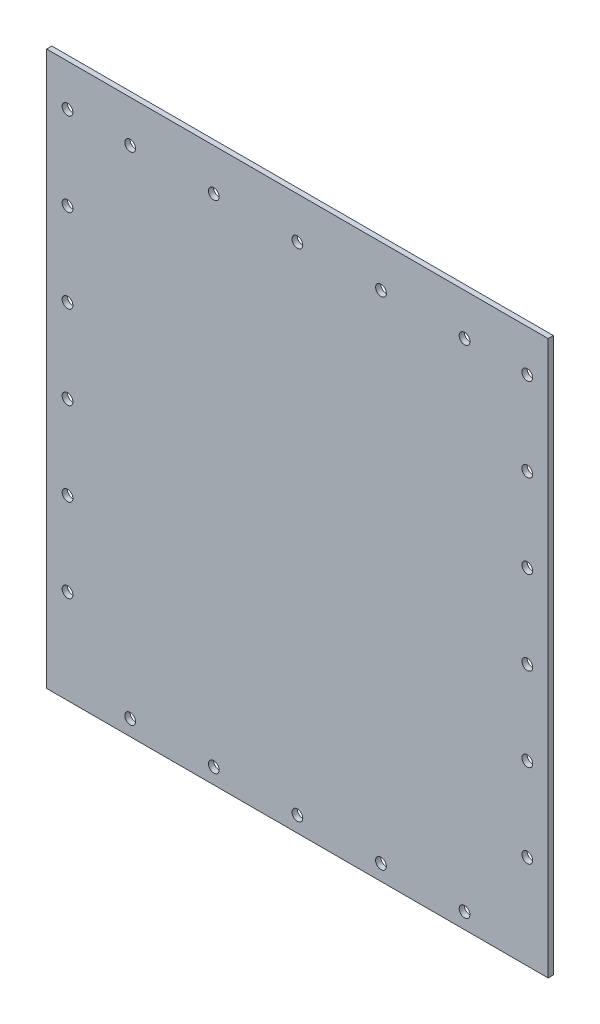
ISO-10303-21;
HEADER;
FILE_DESCRIPTION(('STEP AP214'),'2;1');
FILE_NAME('part.step','',(''),(''),'','','');
FILE_SCHEMA(('AUTOMOTIVE_DESIGN { 1 0 10303 214 1 1 1 1 }'));
ENDSEC;
DATA;
#1=APPLICATION_CONTEXT('core data for automotive mechanical design processes');
#2=APPLICATION_PROTOCOL_DEFINITION('international standard','automotive_design',2000,#1);
#3=PRODUCT_CONTEXT('',#1,'mechanical');
#4=PRODUCT('Part','Part','',(#3));
#5=PRODUCT_RELATED_PRODUCT_CATEGORY('part','',(#4));
#6=PRODUCT_DEFINITION_FORMATION('','',#4);
#7=PRODUCT_DEFINITION_CONTEXT('part definition',#1,'design');
#8=PRODUCT_DEFINITION('design','',#6,#7);
#9=PRODUCT_DEFINITION_SHAPE('','',#8);
#10=(LENGTH_UNIT() NAMED_UNIT(*) SI_UNIT(.MILLI.,.METRE.));
#11=(NAMED_UNIT(*) PLANE_ANGLE_UNIT() SI_UNIT($,.RADIAN.));
#12=(NAMED_UNIT(*) SI_UNIT($,.STERADIAN.) SOLID_ANGLE_UNIT());
#13=UNCERTAINTY_MEASURE_WITH_UNIT(LENGTH_MEASURE(1.E-05),#10,'distance_accuracy_value','');
#14=(GEOMETRIC_REPRESENTATION_CONTEXT(3) GLOBAL_UNCERTAINTY_ASSIGNED_CONTEXT((#13)) GLOBAL_UNIT_ASSIGNED_CONTEXT((#10,
#11,#12)) REPRESENTATION_CONTEXT('',''));
#15=CARTESIAN_POINT('',(0.,0.,0.));
#16=DIRECTION('',(0.,0.,1.));
#17=DIRECTION('',(1.,0.,0.));
#18=AXIS2_PLACEMENT_3D('',#15,#16,#17);
#19=CARTESIAN_POINT('',(0.,-101.6,1.5875));
#20=DIRECTION('',(0.,1.,0.));
#21=DIRECTION('',(0.,0.,1.));
#22=AXIS2_PLACEMENT_3D('',#19,#20,#21);
#23=PLANE('',#22);
#24=DIRECTION('',(1.,0.,0.));
#25=VECTOR('',#24,1.);
#26=CARTESIAN_POINT('',(0.,-101.6,0.));
#27=LINE('',#26,#25);
#28=CARTESIAN_POINT('',(0.,-101.6,0.));
#29=VERTEX_POINT('',#28);
#30=CARTESIAN_POINT('',(152.4,-101.6,0.));
#31=VERTEX_POINT('',#30);
#32=EDGE_CURVE('E121',#29,#31,#27,.T.);
#33=ORIENTED_EDGE('',*,*,#32,.F.);
#34=DIRECTION('',(0.,0.,-1.));
#35=VECTOR('',#34,1.);
#36=CARTESIAN_POINT('',(0.,-101.6,1.5875));
#37=LINE('',#36,#35);
#38=CARTESIAN_POINT('',(0.,-101.6,1.5875));
#39=VERTEX_POINT('',#38);
#40=EDGE_CURVE('E11',#39,#29,#37,.T.);
#41=ORIENTED_EDGE('',*,*,#40,.F.);
#42=DIRECTION('',(1.,0.,0.));
#43=VECTOR('',#42,1.);
#44=CARTESIAN_POINT('',(0.,-101.6,1.5875));
#45=LINE('',#44,#43);
#46=CARTESIAN_POINT('',(152.4,-101.6,1.5875));
#47=VERTEX_POINT('',#46);
#48=EDGE_CURVE('E98',#39,#47,#45,.T.);
#49=ORIENTED_EDGE('',*,*,#48,.T.);
#50=DIRECTION('',(0.,0.,-1.));
#51=VECTOR('',#50,1.);
#52=CARTESIAN_POINT('',(152.4,-101.6,1.5875));
#53=LINE('',#52,#51);
#54=EDGE_CURVE('E59',#47,#31,#53,.T.);
#55=ORIENTED_EDGE('',*,*,#54,.T.);
#56=EDGE_LOOP('',(#33,#41,#49,#55));
#57=FACE_BOUND('',#56,.T.);
#58=ADVANCED_FACE('F41',(#57),#23,.T.);
#59=CARTESIAN_POINT('',(0.,0.,1.5875));
#60=DIRECTION('',(1.,0.,0.));
#61=DIRECTION('',(0.,0.,-1.));
#62=AXIS2_PLACEMENT_3D('',#59,#60,#61);
#63=PLANE('',#62);
#64=DIRECTION('',(0.,-1.,0.));
#65=VECTOR('',#64,1.);
#66=CARTESIAN_POINT('',(0.,0.,0.));
#67=LINE('',#66,#65);
#68=CARTESIAN_POINT('',(0.,-269.8716,0.));
#69=VERTEX_POINT('',#68);
#70=EDGE_CURVE('E104',#29,#69,#67,.T.);
#71=ORIENTED_EDGE('',*,*,#70,.T.);
#72=DIRECTION('',(0.,0.,-1.));
#73=VECTOR('',#72,1.);
#74=CARTESIAN_POINT('',(0.,-269.8716,1.5875));
#75=LINE('',#74,#73);
#76=CARTESIAN_POINT('',(0.,-269.8716,1.5875));
#77=VERTEX_POINT('',#76);
#78=EDGE_CURVE('E51',#77,#69,#75,.T.);
#79=ORIENTED_EDGE('',*,*,#78,.F.);
#80=DIRECTION('',(0.,-1.,0.));
#81=VECTOR('',#80,1.);
#82=CARTESIAN_POINT('',(0.,0.,1.5875));
#83=LINE('',#82,#81);
#84=EDGE_CURVE('E94',#39,#77,#83,.T.);
#85=ORIENTED_EDGE('',*,*,#84,.F.);
#86=ORIENTED_EDGE('',*,*,#40,.T.);
#87=EDGE_LOOP('',(#71,#79,#85,#86));
#88=FACE_BOUND('',#87,.T.);
#89=ADVANCED_FACE('F102',(#88),#63,.F.);
#90=CARTESIAN_POINT('',(0.,-269.8716,1.5875));
#91=DIRECTION('',(0.,1.,0.));
#92=DIRECTION('',(0.,0.,1.));
#93=AXIS2_PLACEMENT_3D('',#90,#91,#92);
#94=PLANE('',#93);
#95=DIRECTION('',(1.,0.,0.));
#96=VECTOR('',#95,1.);
#97=CARTESIAN_POINT('',(0.,-269.8716,0.));
#98=LINE('',#97,#96);
#99=CARTESIAN_POINT('',(152.4,-269.8716,0.));
#100=VERTEX_POINT('',#99);
#101=EDGE_CURVE('E116',#69,#100,#98,.T.);
#102=ORIENTED_EDGE('',*,*,#101,.T.);
#103=DIRECTION('',(0.,0.,-1.));
#104=VECTOR('',#103,1.);
#105=CARTESIAN_POINT('',(152.4,-269.8716,1.5875));
#106=LINE('',#105,#104);
#107=CARTESIAN_POINT('',(152.4,-269.8716,1.5875));
#108=VERTEX_POINT('',#107);
#109=EDGE_CURVE('E73',#108,#100,#106,.T.);
#110=ORIENTED_EDGE('',*,*,#109,.F.);
#111=DIRECTION('',(1.,0.,0.));
#112=VECTOR('',#111,1.);
#113=CARTESIAN_POINT('',(0.,-269.8716,1.5875));
#114=LINE('',#113,#112);
#115=EDGE_CURVE('E85',#77,#108,#114,.T.);
#116=ORIENTED_EDGE('',*,*,#115,.F.);
#117=ORIENTED_EDGE('',*,*,#78,.T.);
#118=EDGE_LOOP('',(#102,#110,#116,#117));
#119=FACE_BOUND('',#118,.T.);
#120=ADVANCED_FACE('F87',(#119),#94,.F.);
#121=CARTESIAN_POINT('',(146.05,-114.3,1.5875));
#122=DIRECTION('',(0.,0.,-1.));
#123=DIRECTION('',(-1.,0.,0.));
#124=AXIS2_PLACEMENT_3D('',#121,#122,#123);
#125=CYLINDRICAL_SURFACE('',#124,1.63195);
#126=CARTESIAN_POINT('',(146.05,-114.3,1.5875));
#127=DIRECTION('',(0.,0.,1.));
#128=DIRECTION('',(1.,0.,0.));
#129=AXIS2_PLACEMENT_3D('',#126,#127,#128);
#130=CIRCLE('',#129,1.63195);
#131=CARTESIAN_POINT('',(147.68195,-114.3,1.5875));
#132=VERTEX_POINT('',#131);
#133=EDGE_CURVE('E216',#132,#132,#130,.T.);
#134=ORIENTED_EDGE('',*,*,#133,.T.);
#135=EDGE_LOOP('',(#134));
#136=FACE_BOUND('',#135,.T.);
#137=CARTESIAN_POINT('',(146.05,-114.3,0.));
#138=DIRECTION('',(0.,0.,1.));
#139=DIRECTION('',(1.,0.,0.));
#140=AXIS2_PLACEMENT_3D('',#137,#138,#139);
#141=CIRCLE('',#140,1.63195);
#142=CARTESIAN_POINT('',(147.68195,-114.3,0.));
#143=VERTEX_POINT('',#142);
#144=EDGE_CURVE('E124',#143,#143,#141,.T.);
#145=ORIENTED_EDGE('',*,*,#144,.F.);
#146=EDGE_LOOP('',(#145));
#147=FACE_BOUND('',#146,.T.);
#148=ADVANCED_FACE('F353',(#136,#147),#125,.F.);
#149=CARTESIAN_POINT('',(146.05,-139.7,1.5875));
#150=DIRECTION('',(0.,0.,-1.));
#151=DIRECTION('',(-1.,0.,0.));
#152=AXIS2_PLACEMENT_3D('',#149,#150,#151);
#153=CYLINDRICAL_SURFACE('',#152,1.63195000000003);
#154=CARTESIAN_POINT('',(146.05,-139.7,1.5875));
#155=DIRECTION('',(0.,0.,1.));
#156=DIRECTION('',(1.,0.,0.));
#157=AXIS2_PLACEMENT_3D('',#154,#155,#156);
#158=CIRCLE('',#157,1.63195000000003);
#159=CARTESIAN_POINT('',(147.68195,-139.7,1.5875));
#160=VERTEX_POINT('',#159);
#161=EDGE_CURVE('E220',#160,#160,#158,.T.);
#162=ORIENTED_EDGE('',*,*,#161,.T.);
#163=EDGE_LOOP('',(#162));
#164=FACE_BOUND('',#163,.T.);
#165=CARTESIAN_POINT('',(146.05,-139.7,0.));
#166=DIRECTION('',(0.,0.,1.));
#167=DIRECTION('',(1.,0.,0.));
#168=AXIS2_PLACEMENT_3D('',#165,#166,#167);
#169=CIRCLE('',#168,1.63195000000003);
#170=CARTESIAN_POINT('',(147.68195,-139.7,0.));
#171=VERTEX_POINT('',#170);
#172=EDGE_CURVE('E128',#171,#171,#169,.T.);
#173=ORIENTED_EDGE('',*,*,#172,.F.);
#174=EDGE_LOOP('',(#173));
#175=FACE_BOUND('',#174,.T.);
#176=ADVANCED_FACE('F356',(#164,#175),#153,.F.);
#177=CARTESIAN_POINT('',(146.05,-165.1,1.5875));
#178=DIRECTION('',(0.,0.,-1.));
#179=DIRECTION('',(-1.,0.,0.));
#180=AXIS2_PLACEMENT_3D('',#177,#178,#179);
#181=CYLINDRICAL_SURFACE('',#180,1.63195000000003);
#182=CARTESIAN_POINT('',(146.05,-165.1,1.5875));
#183=DIRECTION('',(0.,0.,1.));
#184=DIRECTION('',(1.,0.,0.));
#185=AXIS2_PLACEMENT_3D('',#182,#183,#184);
#186=CIRCLE('',#185,1.63195000000003);
#187=CARTESIAN_POINT('',(147.68195,-165.1,1.5875));
#188=VERTEX_POINT('',#187);
#189=EDGE_CURVE('E224',#188,#188,#186,.T.);
#190=ORIENTED_EDGE('',*,*,#189,.T.);
#191=EDGE_LOOP('',(#190));
#192=FACE_BOUND('',#191,.T.);
#193=CARTESIAN_POINT('',(146.05,-165.1,0.));
#194=DIRECTION('',(0.,0.,1.));
#195=DIRECTION('',(1.,0.,0.));
#196=AXIS2_PLACEMENT_3D('',#193,#194,#195);
#197=CIRCLE('',#196,1.63195000000003);
#198=CARTESIAN_POINT('',(147.68195,-165.1,0.));
#199=VERTEX_POINT('',#198);
#200=EDGE_CURVE('E132',#199,#199,#197,.T.);
#201=ORIENTED_EDGE('',*,*,#200,.F.);
#202=EDGE_LOOP('',(#201));
#203=FACE_BOUND('',#202,.T.);
#204=ADVANCED_FACE('F380',(#192,#203),#181,.F.);
#205=CARTESIAN_POINT('',(146.05,-190.5,1.5875));
#206=DIRECTION('',(0.,0.,-1.));
#207=DIRECTION('',(-1.,0.,0.));
#208=AXIS2_PLACEMENT_3D('',#205,#206,#207);
#209=CYLINDRICAL_SURFACE('',#208,1.63195000000003);
#210=CARTESIAN_POINT('',(146.05,-190.5,1.5875));
#211=DIRECTION('',(0.,0.,1.));
#212=DIRECTION('',(1.,0.,0.));
#213=AXIS2_PLACEMENT_3D('',#210,#211,#212);
#214=CIRCLE('',#213,1.63195000000003);
#215=CARTESIAN_POINT('',(147.68195,-190.5,1.5875));
#216=VERTEX_POINT('',#215);
#217=EDGE_CURVE('E228',#216,#216,#214,.T.);
#218=ORIENTED_EDGE('',*,*,#217,.T.);
#219=EDGE_LOOP('',(#218));
#220=FACE_BOUND('',#219,.T.);
#221=CARTESIAN_POINT('',(146.05,-190.5,0.));
#222=DIRECTION('',(0.,0.,1.));
#223=DIRECTION('',(1.,0.,0.));
#224=AXIS2_PLACEMENT_3D('',#221,#222,#223);
#225=CIRCLE('',#224,1.63195000000003);
#226=CARTESIAN_POINT('',(147.68195,-190.5,0.));
#227=VERTEX_POINT('',#226);
#228=EDGE_CURVE('E136',#227,#227,#225,.T.);
#229=ORIENTED_EDGE('',*,*,#228,.F.);
#230=EDGE_LOOP('',(#229));
#231=FACE_BOUND('',#230,.T.);
#232=ADVANCED_FACE('F384',(#220,#231),#209,.F.);
#233=CARTESIAN_POINT('',(146.05,-215.9,1.5875));
#234=DIRECTION('',(0.,0.,-1.));
#235=DIRECTION('',(-1.,0.,0.));
#236=AXIS2_PLACEMENT_3D('',#233,#234,#235);
#237=CYLINDRICAL_SURFACE('',#236,1.63195000000003);
#238=CARTESIAN_POINT('',(146.05,-215.9,1.5875));
#239=DIRECTION('',(0.,0.,1.));
#240=DIRECTION('',(1.,0.,0.));
#241=AXIS2_PLACEMENT_3D('',#238,#239,#240);
#242=CIRCLE('',#241,1.63195000000003);
#243=CARTESIAN_POINT('',(147.68195,-215.9,1.5875));
#244=VERTEX_POINT('',#243);
#245=EDGE_CURVE('E232',#244,#244,#242,.T.);
#246=ORIENTED_EDGE('',*,*,#245,.T.);
#247=EDGE_LOOP('',(#246));
#248=FACE_BOUND('',#247,.T.);
#249=CARTESIAN_POINT('',(146.05,-215.9,0.));
#250=DIRECTION('',(0.,0.,1.));
#251=DIRECTION('',(1.,0.,0.));
#252=AXIS2_PLACEMENT_3D('',#249,#250,#251);
#253=CIRCLE('',#252,1.63195000000003);
#254=CARTESIAN_POINT('',(147.68195,-215.9,0.));
#255=VERTEX_POINT('',#254);
#256=EDGE_CURVE('E140',#255,#255,#253,.T.);
#257=ORIENTED_EDGE('',*,*,#256,.F.);
#258=EDGE_LOOP('',(#257));
#259=FACE_BOUND('',#258,.T.);
#260=ADVANCED_FACE('F388',(#248,#259),#237,.F.);
#261=CARTESIAN_POINT('',(146.05,-241.3,1.5875));
#262=DIRECTION('',(0.,0.,-1.));
#263=DIRECTION('',(-1.,0.,0.));
#264=AXIS2_PLACEMENT_3D('',#261,#262,#263);
#265=CYLINDRICAL_SURFACE('',#264,1.63195000000003);
#266=CARTESIAN_POINT('',(146.05,-241.3,1.5875));
#267=DIRECTION('',(0.,0.,1.));
#268=DIRECTION('',(1.,0.,0.));
#269=AXIS2_PLACEMENT_3D('',#266,#267,#268);
#270=CIRCLE('',#269,1.63195000000003);
#271=CARTESIAN_POINT('',(147.68195,-241.3,1.5875));
#272=VERTEX_POINT('',#271);
#273=EDGE_CURVE('E236',#272,#272,#270,.T.);
#274=ORIENTED_EDGE('',*,*,#273,.T.);
#275=EDGE_LOOP('',(#274));
#276=FACE_BOUND('',#275,.T.);
#277=CARTESIAN_POINT('',(146.05,-241.3,0.));
#278=DIRECTION('',(0.,0.,1.));
#279=DIRECTION('',(1.,0.,0.));
#280=AXIS2_PLACEMENT_3D('',#277,#278,#279);
#281=CIRCLE('',#280,1.63195000000003);
#282=CARTESIAN_POINT('',(147.68195,-241.3,0.));
#283=VERTEX_POINT('',#282);
#284=EDGE_CURVE('E144',#283,#283,#281,.T.);
#285=ORIENTED_EDGE('',*,*,#284,.F.);
#286=EDGE_LOOP('',(#285));
#287=FACE_BOUND('',#286,.T.);
#288=ADVANCED_FACE('F392',(#276,#287),#265,.F.);
#289=CARTESIAN_POINT('',(6.35000000000001,-114.3,1.5875));
#290=DIRECTION('',(0.,0.,-1.));
#291=DIRECTION('',(-1.,0.,0.));
#292=AXIS2_PLACEMENT_3D('',#289,#290,#291);
#293=CYLINDRICAL_SURFACE('',#292,1.63195);
#294=CARTESIAN_POINT('',(6.35000000000001,-114.3,1.5875));
#295=DIRECTION('',(0.,0.,1.));
#296=DIRECTION('',(1.,0.,0.));
#297=AXIS2_PLACEMENT_3D('',#294,#295,#296);
#298=CIRCLE('',#297,1.63195);
#299=CARTESIAN_POINT('',(7.98195000000001,-114.3,1.5875));
#300=VERTEX_POINT('',#299);
#301=EDGE_CURVE('E240',#300,#300,#298,.T.);
#302=ORIENTED_EDGE('',*,*,#301,.T.);
#303=EDGE_LOOP('',(#302));
#304=FACE_BOUND('',#303,.T.);
#305=CARTESIAN_POINT('',(6.35000000000001,-114.3,0.));
#306=DIRECTION('',(0.,0.,1.));
#307=DIRECTION('',(1.,0.,0.));
#308=AXIS2_PLACEMENT_3D('',#305,#306,#307);
#309=CIRCLE('',#308,1.63195);
#310=CARTESIAN_POINT('',(7.98195000000001,-114.3,0.));
#311=VERTEX_POINT('',#310);
#312=EDGE_CURVE('E148',#311,#311,#309,.T.);
#313=ORIENTED_EDGE('',*,*,#312,.F.);
#314=EDGE_LOOP('',(#313));
#315=FACE_BOUND('',#314,.T.);
#316=ADVANCED_FACE('F396',(#304,#315),#293,.F.);
#317=CARTESIAN_POINT('',(6.35000000000001,-139.7,1.5875));
#318=DIRECTION('',(0.,0.,-1.));
#319=DIRECTION('',(-1.,0.,0.));
#320=AXIS2_PLACEMENT_3D('',#317,#318,#319);
#321=CYLINDRICAL_SURFACE('',#320,1.63195000000001);
#322=CARTESIAN_POINT('',(6.35000000000001,-139.7,1.5875));
#323=DIRECTION('',(0.,0.,1.));
#324=DIRECTION('',(1.,0.,0.));
#325=AXIS2_PLACEMENT_3D('',#322,#323,#324);
#326=CIRCLE('',#325,1.63195000000001);
#327=CARTESIAN_POINT('',(7.98195000000002,-139.7,1.5875));
#328=VERTEX_POINT('',#327);
#329=EDGE_CURVE('E244',#328,#328,#326,.T.);
#330=ORIENTED_EDGE('',*,*,#329,.T.);
#331=EDGE_LOOP('',(#330));
#332=FACE_BOUND('',#331,.T.);
#333=CARTESIAN_POINT('',(6.35000000000001,-139.7,0.));
#334=DIRECTION('',(0.,0.,1.));
#335=DIRECTION('',(1.,0.,0.));
#336=AXIS2_PLACEMENT_3D('',#333,#334,#335);
#337=CIRCLE('',#336,1.63195000000001);
#338=CARTESIAN_POINT('',(7.98195000000002,-139.7,0.));
#339=VERTEX_POINT('',#338);
#340=EDGE_CURVE('E152',#339,#339,#337,.T.);
#341=ORIENTED_EDGE('',*,*,#340,.F.);
#342=EDGE_LOOP('',(#341));
#343=FACE_BOUND('',#342,.T.);
#344=ADVANCED_FACE('F400',(#332,#343),#321,.F.);
#345=CARTESIAN_POINT('',(6.35000000000001,-165.1,1.5875));
#346=DIRECTION('',(0.,0.,-1.));
#347=DIRECTION('',(-1.,0.,0.));
#348=AXIS2_PLACEMENT_3D('',#345,#346,#347);
#349=CYLINDRICAL_SURFACE('',#348,1.63195000000001);
#350=CARTESIAN_POINT('',(6.35000000000001,-165.1,1.5875));
#351=DIRECTION('',(0.,0.,1.));
#352=DIRECTION('',(1.,0.,0.));
#353=AXIS2_PLACEMENT_3D('',#350,#351,#352);
#354=CIRCLE('',#353,1.63195000000001);
#355=CARTESIAN_POINT('',(7.98195000000002,-165.1,1.5875));
#356=VERTEX_POINT('',#355);
#357=EDGE_CURVE('E248',#356,#356,#354,.T.);
#358=ORIENTED_EDGE('',*,*,#357,.T.);
#359=EDGE_LOOP('',(#358));
#360=FACE_BOUND('',#359,.T.);
#361=CARTESIAN_POINT('',(6.35000000000001,-165.1,0.));
#362=DIRECTION('',(0.,0.,1.));
#363=DIRECTION('',(1.,0.,0.));
#364=AXIS2_PLACEMENT_3D('',#361,#362,#363);
#365=CIRCLE('',#364,1.63195000000001);
#366=CARTESIAN_POINT('',(7.98195000000002,-165.1,0.));
#367=VERTEX_POINT('',#366);
#368=EDGE_CURVE('E156',#367,#367,#365,.T.);
#369=ORIENTED_EDGE('',*,*,#368,.F.);
#370=EDGE_LOOP('',(#369));
#371=FACE_BOUND('',#370,.T.);
#372=ADVANCED_FACE('F404',(#360,#371),#349,.F.);
#373=CARTESIAN_POINT('',(6.35000000000002,-190.5,1.5875));
#374=DIRECTION('',(0.,0.,-1.));
#375=DIRECTION('',(-1.,0.,0.));
#376=AXIS2_PLACEMENT_3D('',#373,#374,#375);
#377=CYLINDRICAL_SURFACE('',#376,1.63195000000001);
#378=CARTESIAN_POINT('',(6.35000000000002,-190.5,1.5875));
#379=DIRECTION('',(0.,0.,1.));
#380=DIRECTION('',(1.,0.,0.));
#381=AXIS2_PLACEMENT_3D('',#378,#379,#380);
#382=CIRCLE('',#381,1.63195000000001);
#383=CARTESIAN_POINT('',(7.98195000000003,-190.5,1.5875));
#384=VERTEX_POINT('',#383);
#385=EDGE_CURVE('E252',#384,#384,#382,.T.);
#386=ORIENTED_EDGE('',*,*,#385,.T.);
#387=EDGE_LOOP('',(#386));
#388=FACE_BOUND('',#387,.T.);
#389=CARTESIAN_POINT('',(6.35000000000002,-190.5,0.));
#390=DIRECTION('',(0.,0.,1.));
#391=DIRECTION('',(1.,0.,0.));
#392=AXIS2_PLACEMENT_3D('',#389,#390,#391);
#393=CIRCLE('',#392,1.63195000000001);
#394=CARTESIAN_POINT('',(7.98195000000003,-190.5,0.));
#395=VERTEX_POINT('',#394);
#396=EDGE_CURVE('E160',#395,#395,#393,.T.);
#397=ORIENTED_EDGE('',*,*,#396,.F.);
#398=EDGE_LOOP('',(#397));
#399=FACE_BOUND('',#398,.T.);
#400=ADVANCED_FACE('F408',(#388,#399),#377,.F.);
#401=CARTESIAN_POINT('',(6.35000000000002,-215.9,1.5875));
#402=DIRECTION('',(0.,0.,-1.));
#403=DIRECTION('',(-1.,0.,0.));
#404=AXIS2_PLACEMENT_3D('',#401,#402,#403);
#405=CYLINDRICAL_SURFACE('',#404,1.63195000000001);
#406=CARTESIAN_POINT('',(6.35000000000002,-215.9,1.5875));
#407=DIRECTION('',(0.,0.,1.));
#408=DIRECTION('',(1.,0.,0.));
#409=AXIS2_PLACEMENT_3D('',#406,#407,#408);
#410=CIRCLE('',#409,1.63195000000001);
#411=CARTESIAN_POINT('',(7.98195000000003,-215.9,1.5875));
#412=VERTEX_POINT('',#411);
#413=EDGE_CURVE('E256',#412,#412,#410,.T.);
#414=ORIENTED_EDGE('',*,*,#413,.T.);
#415=EDGE_LOOP('',(#414));
#416=FACE_BOUND('',#415,.T.);
#417=CARTESIAN_POINT('',(6.35000000000002,-215.9,0.));
#418=DIRECTION('',(0.,0.,1.));
#419=DIRECTION('',(1.,0.,0.));
#420=AXIS2_PLACEMENT_3D('',#417,#418,#419);
#421=CIRCLE('',#420,1.63195000000001);
#422=CARTESIAN_POINT('',(7.98195000000003,-215.9,0.));
#423=VERTEX_POINT('',#422);
#424=EDGE_CURVE('E164',#423,#423,#421,.T.);
#425=ORIENTED_EDGE('',*,*,#424,.F.);
#426=EDGE_LOOP('',(#425));
#427=FACE_BOUND('',#426,.T.);
#428=ADVANCED_FACE('F412',(#416,#427),#405,.F.);
#429=CARTESIAN_POINT('',(6.35000000000002,-241.3,1.5875));
#430=DIRECTION('',(0.,0.,-1.));
#431=DIRECTION('',(-1.,0.,0.));
#432=AXIS2_PLACEMENT_3D('',#429,#430,#431);
#433=CYLINDRICAL_SURFACE('',#432,1.63195000000001);
#434=CARTESIAN_POINT('',(6.35000000000002,-241.3,1.5875));
#435=DIRECTION('',(0.,0.,1.));
#436=DIRECTION('',(1.,0.,0.));
#437=AXIS2_PLACEMENT_3D('',#434,#435,#436);
#438=CIRCLE('',#437,1.63195000000001);
#439=CARTESIAN_POINT('',(7.98195000000003,-241.3,1.5875));
#440=VERTEX_POINT('',#439);
#441=EDGE_CURVE('E260',#440,#440,#438,.T.);
#442=ORIENTED_EDGE('',*,*,#441,.T.);
#443=EDGE_LOOP('',(#442));
#444=FACE_BOUND('',#443,.T.);
#445=CARTESIAN_POINT('',(6.35000000000002,-241.3,0.));
#446=DIRECTION('',(0.,0.,1.));
#447=DIRECTION('',(1.,0.,0.));
#448=AXIS2_PLACEMENT_3D('',#445,#446,#447);
#449=CIRCLE('',#448,1.63195000000001);
#450=CARTESIAN_POINT('',(7.98195000000003,-241.3,0.));
#451=VERTEX_POINT('',#450);
#452=EDGE_CURVE('E168',#451,#451,#449,.T.);
#453=ORIENTED_EDGE('',*,*,#452,.F.);
#454=EDGE_LOOP('',(#453));
#455=FACE_BOUND('',#454,.T.);
#456=ADVANCED_FACE('F416',(#444,#455),#433,.F.);
#457=CARTESIAN_POINT('',(25.4,-265.1125,1.5875));
#458=DIRECTION('',(0.,0.,-1.));
#459=DIRECTION('',(-1.,0.,0.));
#460=AXIS2_PLACEMENT_3D('',#457,#458,#459);
#461=CYLINDRICAL_SURFACE('',#460,1.63195000000002);
#462=CARTESIAN_POINT('',(25.4,-265.1125,1.5875));
#463=DIRECTION('',(0.,0.,1.));
#464=DIRECTION('',(1.,0.,0.));
#465=AXIS2_PLACEMENT_3D('',#462,#463,#464);
#466=CIRCLE('',#465,1.63195000000002);
#467=CARTESIAN_POINT('',(27.03195,-265.1125,1.5875));
#468=VERTEX_POINT('',#467);
#469=EDGE_CURVE('E264',#468,#468,#466,.T.);
#470=ORIENTED_EDGE('',*,*,#469,.T.);
#471=EDGE_LOOP('',(#470));
#472=FACE_BOUND('',#471,.T.);
#473=CARTESIAN_POINT('',(25.4,-265.1125,0.));
#474=DIRECTION('',(0.,0.,1.));
#475=DIRECTION('',(1.,0.,0.));
#476=AXIS2_PLACEMENT_3D('',#473,#474,#475);
#477=CIRCLE('',#476,1.63195000000002);
#478=CARTESIAN_POINT('',(27.03195,-265.1125,0.));
#479=VERTEX_POINT('',#478);
#480=EDGE_CURVE('E172',#479,#479,#477,.T.);
#481=ORIENTED_EDGE('',*,*,#480,.F.);
#482=EDGE_LOOP('',(#481));
#483=FACE_BOUND('',#482,.T.);
#484=ADVANCED_FACE('F420',(#472,#483),#461,.F.);
#485=CARTESIAN_POINT('',(50.8,-265.1125,1.5875));
#486=DIRECTION('',(0.,0.,-1.));
#487=DIRECTION('',(-1.,0.,0.));
#488=AXIS2_PLACEMENT_3D('',#485,#486,#487);
#489=CYLINDRICAL_SURFACE('',#488,1.63195000000001);
#490=CARTESIAN_POINT('',(50.8,-265.1125,1.5875));
#491=DIRECTION('',(0.,0.,1.));
#492=DIRECTION('',(1.,0.,0.));
#493=AXIS2_PLACEMENT_3D('',#490,#491,#492);
#494=CIRCLE('',#493,1.63195000000001);
#495=CARTESIAN_POINT('',(52.43195,-265.1125,1.5875));
#496=VERTEX_POINT('',#495);
#497=EDGE_CURVE('E268',#496,#496,#494,.T.);
#498=ORIENTED_EDGE('',*,*,#497,.T.);
#499=EDGE_LOOP('',(#498));
#500=FACE_BOUND('',#499,.T.);
#501=CARTESIAN_POINT('',(50.8,-265.1125,0.));
#502=DIRECTION('',(0.,0.,1.));
#503=DIRECTION('',(1.,0.,0.));
#504=AXIS2_PLACEMENT_3D('',#501,#502,#503);
#505=CIRCLE('',#504,1.63195000000001);
#506=CARTESIAN_POINT('',(52.43195,-265.1125,0.));
#507=VERTEX_POINT('',#506);
#508=EDGE_CURVE('E176',#507,#507,#505,.T.);
#509=ORIENTED_EDGE('',*,*,#508,.F.);
#510=EDGE_LOOP('',(#509));
#511=FACE_BOUND('',#510,.T.);
#512=ADVANCED_FACE('F424',(#500,#511),#489,.F.);
#513=CARTESIAN_POINT('',(76.2,-265.1125,1.5875));
#514=DIRECTION('',(0.,0.,-1.));
#515=DIRECTION('',(-1.,0.,0.));
#516=AXIS2_PLACEMENT_3D('',#513,#514,#515);
#517=CYLINDRICAL_SURFACE('',#516,1.63195000000001);
#518=CARTESIAN_POINT('',(76.2,-265.1125,1.5875));
#519=DIRECTION('',(0.,0.,1.));
#520=DIRECTION('',(1.,0.,0.));
#521=AXIS2_PLACEMENT_3D('',#518,#519,#520);
#522=CIRCLE('',#521,1.63195000000001);
#523=CARTESIAN_POINT('',(77.83195,-265.1125,1.5875));
#524=VERTEX_POINT('',#523);
#525=EDGE_CURVE('E272',#524,#524,#522,.T.);
#526=ORIENTED_EDGE('',*,*,#525,.T.);
#527=EDGE_LOOP('',(#526));
#528=FACE_BOUND('',#527,.T.);
#529=CARTESIAN_POINT('',(76.2,-265.1125,0.));
#530=DIRECTION('',(0.,0.,1.));
#531=DIRECTION('',(1.,0.,0.));
#532=AXIS2_PLACEMENT_3D('',#529,#530,#531);
#533=CIRCLE('',#532,1.63195000000001);
#534=CARTESIAN_POINT('',(77.83195,-265.1125,0.));
#535=VERTEX_POINT('',#534);
#536=EDGE_CURVE('E180',#535,#535,#533,.T.);
#537=ORIENTED_EDGE('',*,*,#536,.F.);
#538=EDGE_LOOP('',(#537));
#539=FACE_BOUND('',#538,.T.);
#540=ADVANCED_FACE('F428',(#528,#539),#517,.F.);
#541=CARTESIAN_POINT('',(101.6,-265.1125,1.5875));
#542=DIRECTION('',(0.,0.,-1.));
#543=DIRECTION('',(-1.,0.,0.));
#544=AXIS2_PLACEMENT_3D('',#541,#542,#543);
#545=CYLINDRICAL_SURFACE('',#544,1.63195000000001);
#546=CARTESIAN_POINT('',(101.6,-265.1125,1.5875));
#547=DIRECTION('',(0.,0.,1.));
#548=DIRECTION('',(1.,0.,0.));
#549=AXIS2_PLACEMENT_3D('',#546,#547,#548);
#550=CIRCLE('',#549,1.63195000000001);
#551=CARTESIAN_POINT('',(103.23195,-265.1125,1.5875));
#552=VERTEX_POINT('',#551);
#553=EDGE_CURVE('E276',#552,#552,#550,.T.);
#554=ORIENTED_EDGE('',*,*,#553,.T.);
#555=EDGE_LOOP('',(#554));
#556=FACE_BOUND('',#555,.T.);
#557=CARTESIAN_POINT('',(101.6,-265.1125,0.));
#558=DIRECTION('',(0.,0.,1.));
#559=DIRECTION('',(1.,0.,0.));
#560=AXIS2_PLACEMENT_3D('',#557,#558,#559);
#561=CIRCLE('',#560,1.63195000000001);
#562=CARTESIAN_POINT('',(103.23195,-265.1125,0.));
#563=VERTEX_POINT('',#562);
#564=EDGE_CURVE('E184',#563,#563,#561,.T.);
#565=ORIENTED_EDGE('',*,*,#564,.F.);
#566=EDGE_LOOP('',(#565));
#567=FACE_BOUND('',#566,.T.);
#568=ADVANCED_FACE('F432',(#556,#567),#545,.F.);
#569=CARTESIAN_POINT('',(127.,-265.1125,1.5875));
#570=DIRECTION('',(0.,0.,-1.));
#571=DIRECTION('',(-1.,0.,0.));
#572=AXIS2_PLACEMENT_3D('',#569,#570,#571);
#573=CYLINDRICAL_SURFACE('',#572,1.63195000000003);
#574=CARTESIAN_POINT('',(127.,-265.1125,1.5875));
#575=DIRECTION('',(0.,0.,1.));
#576=DIRECTION('',(1.,0.,0.));
#577=AXIS2_PLACEMENT_3D('',#574,#575,#576);
#578=CIRCLE('',#577,1.63195000000003);
#579=CARTESIAN_POINT('',(128.63195,-265.1125,1.5875));
#580=VERTEX_POINT('',#579);
#581=EDGE_CURVE('E280',#580,#580,#578,.T.);
#582=ORIENTED_EDGE('',*,*,#581,.T.);
#583=EDGE_LOOP('',(#582));
#584=FACE_BOUND('',#583,.T.);
#585=CARTESIAN_POINT('',(127.,-265.1125,0.));
#586=DIRECTION('',(0.,0.,1.));
#587=DIRECTION('',(1.,0.,0.));
#588=AXIS2_PLACEMENT_3D('',#585,#586,#587);
#589=CIRCLE('',#588,1.63195000000003);
#590=CARTESIAN_POINT('',(128.63195,-265.1125,0.));
#591=VERTEX_POINT('',#590);
#592=EDGE_CURVE('E188',#591,#591,#589,.T.);
#593=ORIENTED_EDGE('',*,*,#592,.F.);
#594=EDGE_LOOP('',(#593));
#595=FACE_BOUND('',#594,.T.);
#596=ADVANCED_FACE('F436',(#584,#595),#573,.F.);
#597=CARTESIAN_POINT('',(25.4,-114.3,1.5875));
#598=DIRECTION('',(0.,0.,-1.));
#599=DIRECTION('',(-1.,0.,0.));
#600=AXIS2_PLACEMENT_3D('',#597,#598,#599);
#601=CYLINDRICAL_SURFACE('',#600,1.63195);
#602=CARTESIAN_POINT('',(25.4,-114.3,1.5875));
#603=DIRECTION('',(0.,0.,1.));
#604=DIRECTION('',(1.,0.,0.));
#605=AXIS2_PLACEMENT_3D('',#602,#603,#604);
#606=CIRCLE('',#605,1.63195);
#607=CARTESIAN_POINT('',(27.03195,-114.3,1.5875));
#608=VERTEX_POINT('',#607);
#609=EDGE_CURVE('E284',#608,#608,#606,.T.);
#610=ORIENTED_EDGE('',*,*,#609,.T.);
#611=EDGE_LOOP('',(#610));
#612=FACE_BOUND('',#611,.T.);
#613=CARTESIAN_POINT('',(25.4,-114.3,0.));
#614=DIRECTION('',(0.,0.,1.));
#615=DIRECTION('',(1.,0.,0.));
#616=AXIS2_PLACEMENT_3D('',#613,#614,#615);
#617=CIRCLE('',#616,1.63195);
#618=CARTESIAN_POINT('',(27.03195,-114.3,0.));
#619=VERTEX_POINT('',#618);
#620=EDGE_CURVE('E192',#619,#619,#617,.T.);
#621=ORIENTED_EDGE('',*,*,#620,.F.);
#622=EDGE_LOOP('',(#621));
#623=FACE_BOUND('',#622,.T.);
#624=ADVANCED_FACE('F440',(#612,#623),#601,.F.);
#625=CARTESIAN_POINT('',(50.8,-114.3,1.5875));
#626=DIRECTION('',(0.,0.,-1.));
#627=DIRECTION('',(-1.,0.,0.));
#628=AXIS2_PLACEMENT_3D('',#625,#626,#627);
#629=CYLINDRICAL_SURFACE('',#628,1.63194999999999);
#630=CARTESIAN_POINT('',(50.8,-114.3,1.5875));
#631=DIRECTION('',(0.,0.,1.));
#632=DIRECTION('',(1.,0.,0.));
#633=AXIS2_PLACEMENT_3D('',#630,#631,#632);
#634=CIRCLE('',#633,1.63194999999999);
#635=CARTESIAN_POINT('',(52.43195,-114.3,1.5875));
#636=VERTEX_POINT('',#635);
#637=EDGE_CURVE('E288',#636,#636,#634,.T.);
#638=ORIENTED_EDGE('',*,*,#637,.T.);
#639=EDGE_LOOP('',(#638));
#640=FACE_BOUND('',#639,.T.);
#641=CARTESIAN_POINT('',(50.8,-114.3,0.));
#642=DIRECTION('',(0.,0.,1.));
#643=DIRECTION('',(1.,0.,0.));
#644=AXIS2_PLACEMENT_3D('',#641,#642,#643);
#645=CIRCLE('',#644,1.63194999999999);
#646=CARTESIAN_POINT('',(52.43195,-114.3,0.));
#647=VERTEX_POINT('',#646);
#648=EDGE_CURVE('E196',#647,#647,#645,.T.);
#649=ORIENTED_EDGE('',*,*,#648,.F.);
#650=EDGE_LOOP('',(#649));
#651=FACE_BOUND('',#650,.T.);
#652=ADVANCED_FACE('F444',(#640,#651),#629,.F.);
#653=CARTESIAN_POINT('',(76.2,-114.3,1.5875));
#654=DIRECTION('',(0.,0.,-1.));
#655=DIRECTION('',(-1.,0.,0.));
#656=AXIS2_PLACEMENT_3D('',#653,#654,#655);
#657=CYLINDRICAL_SURFACE('',#656,1.63195);
#658=CARTESIAN_POINT('',(76.2,-114.3,1.5875));
#659=DIRECTION('',(0.,0.,1.));
#660=DIRECTION('',(1.,0.,0.));
#661=AXIS2_PLACEMENT_3D('',#658,#659,#660);
#662=CIRCLE('',#661,1.63195);
#663=CARTESIAN_POINT('',(77.83195,-114.3,1.5875));
#664=VERTEX_POINT('',#663);
#665=EDGE_CURVE('E292',#664,#664,#662,.T.);
#666=ORIENTED_EDGE('',*,*,#665,.T.);
#667=EDGE_LOOP('',(#666));
#668=FACE_BOUND('',#667,.T.);
#669=CARTESIAN_POINT('',(76.2,-114.3,0.));
#670=DIRECTION('',(0.,0.,1.));
#671=DIRECTION('',(1.,0.,0.));
#672=AXIS2_PLACEMENT_3D('',#669,#670,#671);
#673=CIRCLE('',#672,1.63195);
#674=CARTESIAN_POINT('',(77.83195,-114.3,0.));
#675=VERTEX_POINT('',#674);
#676=EDGE_CURVE('E200',#675,#675,#673,.T.);
#677=ORIENTED_EDGE('',*,*,#676,.F.);
#678=EDGE_LOOP('',(#677));
#679=FACE_BOUND('',#678,.T.);
#680=ADVANCED_FACE('F448',(#668,#679),#657,.F.);
#681=CARTESIAN_POINT('',(101.6,-114.3,1.5875));
#682=DIRECTION('',(0.,0.,-1.));
#683=DIRECTION('',(-1.,0.,0.));
#684=AXIS2_PLACEMENT_3D('',#681,#682,#683);
#685=CYLINDRICAL_SURFACE('',#684,1.63195);
#686=CARTESIAN_POINT('',(101.6,-114.3,1.5875));
#687=DIRECTION('',(0.,0.,1.));
#688=DIRECTION('',(1.,0.,0.));
#689=AXIS2_PLACEMENT_3D('',#686,#687,#688);
#690=CIRCLE('',#689,1.63195);
#691=CARTESIAN_POINT('',(103.23195,-114.3,1.5875));
#692=VERTEX_POINT('',#691);
#693=EDGE_CURVE('E296',#692,#692,#690,.T.);
#694=ORIENTED_EDGE('',*,*,#693,.T.);
#695=EDGE_LOOP('',(#694));
#696=FACE_BOUND('',#695,.T.);
#697=CARTESIAN_POINT('',(101.6,-114.3,0.));
#698=DIRECTION('',(0.,0.,1.));
#699=DIRECTION('',(1.,0.,0.));
#700=AXIS2_PLACEMENT_3D('',#697,#698,#699);
#701=CIRCLE('',#700,1.63195);
#702=CARTESIAN_POINT('',(103.23195,-114.3,0.));
#703=VERTEX_POINT('',#702);
#704=EDGE_CURVE('E204',#703,#703,#701,.T.);
#705=ORIENTED_EDGE('',*,*,#704,.F.);
#706=EDGE_LOOP('',(#705));
#707=FACE_BOUND('',#706,.T.);
#708=ADVANCED_FACE('F369',(#696,#707),#685,.F.);
#709=CARTESIAN_POINT('',(127.,-114.3,1.5875));
#710=DIRECTION('',(0.,0.,-1.));
#711=DIRECTION('',(-1.,0.,0.));
#712=AXIS2_PLACEMENT_3D('',#709,#710,#711);
#713=CYLINDRICAL_SURFACE('',#712,1.63195);
#714=CARTESIAN_POINT('',(127.,-114.3,1.5875));
#715=DIRECTION('',(0.,0.,1.));
#716=DIRECTION('',(1.,0.,0.));
#717=AXIS2_PLACEMENT_3D('',#714,#715,#716);
#718=CIRCLE('',#717,1.63195);
#719=CARTESIAN_POINT('',(128.63195,-114.3,1.5875));
#720=VERTEX_POINT('',#719);
#721=EDGE_CURVE('E115',#720,#720,#718,.T.);
#722=ORIENTED_EDGE('',*,*,#721,.T.);
#723=EDGE_LOOP('',(#722));
#724=FACE_BOUND('',#723,.T.);
#725=CARTESIAN_POINT('',(127.,-114.3,0.));
#726=DIRECTION('',(0.,0.,1.));
#727=DIRECTION('',(1.,0.,0.));
#728=AXIS2_PLACEMENT_3D('',#725,#726,#727);
#729=CIRCLE('',#728,1.63195);
#730=CARTESIAN_POINT('',(128.63195,-114.3,0.));
#731=VERTEX_POINT('',#730);
#732=EDGE_CURVE('E208',#731,#731,#729,.T.);
#733=ORIENTED_EDGE('',*,*,#732,.F.);
#734=EDGE_LOOP('',(#733));
#735=FACE_BOUND('',#734,.T.);
#736=ADVANCED_FACE('F43',(#724,#735),#713,.F.);
#737=CARTESIAN_POINT('',(152.4,0.,1.5875));
#738=DIRECTION('',(1.,0.,0.));
#739=DIRECTION('',(0.,0.,-1.));
#740=AXIS2_PLACEMENT_3D('',#737,#738,#739);
#741=PLANE('',#740);
#742=DIRECTION('',(0.,-1.,0.));
#743=VECTOR('',#742,1.);
#744=CARTESIAN_POINT('',(152.4,0.,0.));
#745=LINE('',#744,#743);
#746=EDGE_CURVE('E111',#31,#100,#745,.T.);
#747=ORIENTED_EDGE('',*,*,#746,.F.);
#748=ORIENTED_EDGE('',*,*,#54,.F.);
#749=DIRECTION('',(0.,-1.,0.));
#750=VECTOR('',#749,1.);
#751=CARTESIAN_POINT('',(152.4,0.,1.5875));
#752=LINE('',#751,#750);
#753=EDGE_CURVE('E93',#47,#108,#752,.T.);
#754=ORIENTED_EDGE('',*,*,#753,.T.);
#755=ORIENTED_EDGE('',*,*,#109,.T.);
#756=EDGE_LOOP('',(#747,#748,#754,#755));
#757=FACE_BOUND('',#756,.T.);
#758=ADVANCED_FACE('F309',(#757),#741,.T.);
#759=CARTESIAN_POINT('',(0.,0.,1.5875));
#760=DIRECTION('',(0.,0.,1.));
#761=DIRECTION('',(1.,0.,0.));
#762=AXIS2_PLACEMENT_3D('',#759,#760,#761);
#763=PLANE('',#762);
#764=ORIENTED_EDGE('',*,*,#721,.F.);
#765=EDGE_LOOP('',(#764));
#766=FACE_BOUND('',#765,.T.);
#767=ORIENTED_EDGE('',*,*,#693,.F.);
#768=EDGE_LOOP('',(#767));
#769=FACE_BOUND('',#768,.T.);
#770=ORIENTED_EDGE('',*,*,#665,.F.);
#771=EDGE_LOOP('',(#770));
#772=FACE_BOUND('',#771,.T.);
#773=ORIENTED_EDGE('',*,*,#637,.F.);
#774=EDGE_LOOP('',(#773));
#775=FACE_BOUND('',#774,.T.);
#776=ORIENTED_EDGE('',*,*,#609,.F.);
#777=EDGE_LOOP('',(#776));
#778=FACE_BOUND('',#777,.T.);
#779=ORIENTED_EDGE('',*,*,#581,.F.);
#780=EDGE_LOOP('',(#779));
#781=FACE_BOUND('',#780,.T.);
#782=ORIENTED_EDGE('',*,*,#553,.F.);
#783=EDGE_LOOP('',(#782));
#784=FACE_BOUND('',#783,.T.);
#785=ORIENTED_EDGE('',*,*,#525,.F.);
#786=EDGE_LOOP('',(#785));
#787=FACE_BOUND('',#786,.T.);
#788=ORIENTED_EDGE('',*,*,#497,.F.);
#789=EDGE_LOOP('',(#788));
#790=FACE_BOUND('',#789,.T.);
#791=ORIENTED_EDGE('',*,*,#469,.F.);
#792=EDGE_LOOP('',(#791));
#793=FACE_BOUND('',#792,.T.);
#794=ORIENTED_EDGE('',*,*,#441,.F.);
#795=EDGE_LOOP('',(#794));
#796=FACE_BOUND('',#795,.T.);
#797=ORIENTED_EDGE('',*,*,#413,.F.);
#798=EDGE_LOOP('',(#797));
#799=FACE_BOUND('',#798,.T.);
#800=ORIENTED_EDGE('',*,*,#385,.F.);
#801=EDGE_LOOP('',(#800));
#802=FACE_BOUND('',#801,.T.);
#803=ORIENTED_EDGE('',*,*,#357,.F.);
#804=EDGE_LOOP('',(#803));
#805=FACE_BOUND('',#804,.T.);
#806=ORIENTED_EDGE('',*,*,#329,.F.);
#807=EDGE_LOOP('',(#806));
#808=FACE_BOUND('',#807,.T.);
#809=ORIENTED_EDGE('',*,*,#301,.F.);
#810=EDGE_LOOP('',(#809));
#811=FACE_BOUND('',#810,.T.);
#812=ORIENTED_EDGE('',*,*,#273,.F.);
#813=EDGE_LOOP('',(#812));
#814=FACE_BOUND('',#813,.T.);
#815=ORIENTED_EDGE('',*,*,#245,.F.);
#816=EDGE_LOOP('',(#815));
#817=FACE_BOUND('',#816,.T.);
#818=ORIENTED_EDGE('',*,*,#217,.F.);
#819=EDGE_LOOP('',(#818));
#820=FACE_BOUND('',#819,.T.);
#821=ORIENTED_EDGE('',*,*,#189,.F.);
#822=EDGE_LOOP('',(#821));
#823=FACE_BOUND('',#822,.T.);
#824=ORIENTED_EDGE('',*,*,#161,.F.);
#825=EDGE_LOOP('',(#824));
#826=FACE_BOUND('',#825,.T.);
#827=ORIENTED_EDGE('',*,*,#133,.F.);
#828=EDGE_LOOP('',(#827));
#829=FACE_BOUND('',#828,.T.);
#830=ORIENTED_EDGE('',*,*,#48,.F.);
#831=ORIENTED_EDGE('',*,*,#84,.T.);
#832=ORIENTED_EDGE('',*,*,#115,.T.);
#833=ORIENTED_EDGE('',*,*,#753,.F.);
#834=EDGE_LOOP('',(#830,#831,#832,#833));
#835=FACE_BOUND('',#834,.T.);
#836=ADVANCED_FACE('F97',(#766,#769,#772,#775,#778,#781,#784,#787,#790,#793,#796,#799,#802,#805,
#808,#811,#814,#817,#820,#823,#826,#829,#835),#763,.T.);
#837=CARTESIAN_POINT('',(0.,0.,0.));
#838=DIRECTION('',(0.,0.,1.));
#839=DIRECTION('',(1.,0.,0.));
#840=AXIS2_PLACEMENT_3D('',#837,#838,#839);
#841=PLANE('',#840);
#842=ORIENTED_EDGE('',*,*,#732,.T.);
#843=EDGE_LOOP('',(#842));
#844=FACE_BOUND('',#843,.T.);
#845=ORIENTED_EDGE('',*,*,#704,.T.);
#846=EDGE_LOOP('',(#845));
#847=FACE_BOUND('',#846,.T.);
#848=ORIENTED_EDGE('',*,*,#676,.T.);
#849=EDGE_LOOP('',(#848));
#850=FACE_BOUND('',#849,.T.);
#851=ORIENTED_EDGE('',*,*,#648,.T.);
#852=EDGE_LOOP('',(#851));
#853=FACE_BOUND('',#852,.T.);
#854=ORIENTED_EDGE('',*,*,#620,.T.);
#855=EDGE_LOOP('',(#854));
#856=FACE_BOUND('',#855,.T.);
#857=ORIENTED_EDGE('',*,*,#592,.T.);
#858=EDGE_LOOP('',(#857));
#859=FACE_BOUND('',#858,.T.);
#860=ORIENTED_EDGE('',*,*,#564,.T.);
#861=EDGE_LOOP('',(#860));
#862=FACE_BOUND('',#861,.T.);
#863=ORIENTED_EDGE('',*,*,#536,.T.);
#864=EDGE_LOOP('',(#863));
#865=FACE_BOUND('',#864,.T.);
#866=ORIENTED_EDGE('',*,*,#508,.T.);
#867=EDGE_LOOP('',(#866));
#868=FACE_BOUND('',#867,.T.);
#869=ORIENTED_EDGE('',*,*,#480,.T.);
#870=EDGE_LOOP('',(#869));
#871=FACE_BOUND('',#870,.T.);
#872=ORIENTED_EDGE('',*,*,#452,.T.);
#873=EDGE_LOOP('',(#872));
#874=FACE_BOUND('',#873,.T.);
#875=ORIENTED_EDGE('',*,*,#424,.T.);
#876=EDGE_LOOP('',(#875));
#877=FACE_BOUND('',#876,.T.);
#878=ORIENTED_EDGE('',*,*,#396,.T.);
#879=EDGE_LOOP('',(#878));
#880=FACE_BOUND('',#879,.T.);
#881=ORIENTED_EDGE('',*,*,#368,.T.);
#882=EDGE_LOOP('',(#881));
#883=FACE_BOUND('',#882,.T.);
#884=ORIENTED_EDGE('',*,*,#340,.T.);
#885=EDGE_LOOP('',(#884));
#886=FACE_BOUND('',#885,.T.);
#887=ORIENTED_EDGE('',*,*,#312,.T.);
#888=EDGE_LOOP('',(#887));
#889=FACE_BOUND('',#888,.T.);
#890=ORIENTED_EDGE('',*,*,#284,.T.);
#891=EDGE_LOOP('',(#890));
#892=FACE_BOUND('',#891,.T.);
#893=ORIENTED_EDGE('',*,*,#256,.T.);
#894=EDGE_LOOP('',(#893));
#895=FACE_BOUND('',#894,.T.);
#896=ORIENTED_EDGE('',*,*,#228,.T.);
#897=EDGE_LOOP('',(#896));
#898=FACE_BOUND('',#897,.T.);
#899=ORIENTED_EDGE('',*,*,#200,.T.);
#900=EDGE_LOOP('',(#899));
#901=FACE_BOUND('',#900,.T.);
#902=ORIENTED_EDGE('',*,*,#172,.T.);
#903=EDGE_LOOP('',(#902));
#904=FACE_BOUND('',#903,.T.);
#905=ORIENTED_EDGE('',*,*,#144,.T.);
#906=EDGE_LOOP('',(#905));
#907=FACE_BOUND('',#906,.T.);
#908=ORIENTED_EDGE('',*,*,#32,.T.);
#909=ORIENTED_EDGE('',*,*,#746,.T.);
#910=ORIENTED_EDGE('',*,*,#101,.F.);
#911=ORIENTED_EDGE('',*,*,#70,.F.);
#912=EDGE_LOOP('',(#908,#909,#910,#911));
#913=FACE_BOUND('',#912,.T.);
#914=ADVANCED_FACE('F308',(#844,#847,#850,#853,#856,#859,#862,#865,#868,#871,#874,#877,#880,
#883,#886,#889,#892,#895,#898,#901,#904,#907,#913),#841,.F.);
#915=CLOSED_SHELL('',(#58,#89,#120,#148,#176,#204,#232,#260,#288,#316,#344,#372,#400,#428,#456,
#484,#512,#540,#568,#596,#624,#652,#680,#708,#736,#758,#836,#914));
#916=MANIFOLD_SOLID_BREP('B2',#915);
#917=ADVANCED_BREP_SHAPE_REPRESENTATION('',(#18,#916),#14);
#918=SHAPE_DEFINITION_REPRESENTATION(#9,#917);
ENDSEC;
END-ISO-10303-21;
